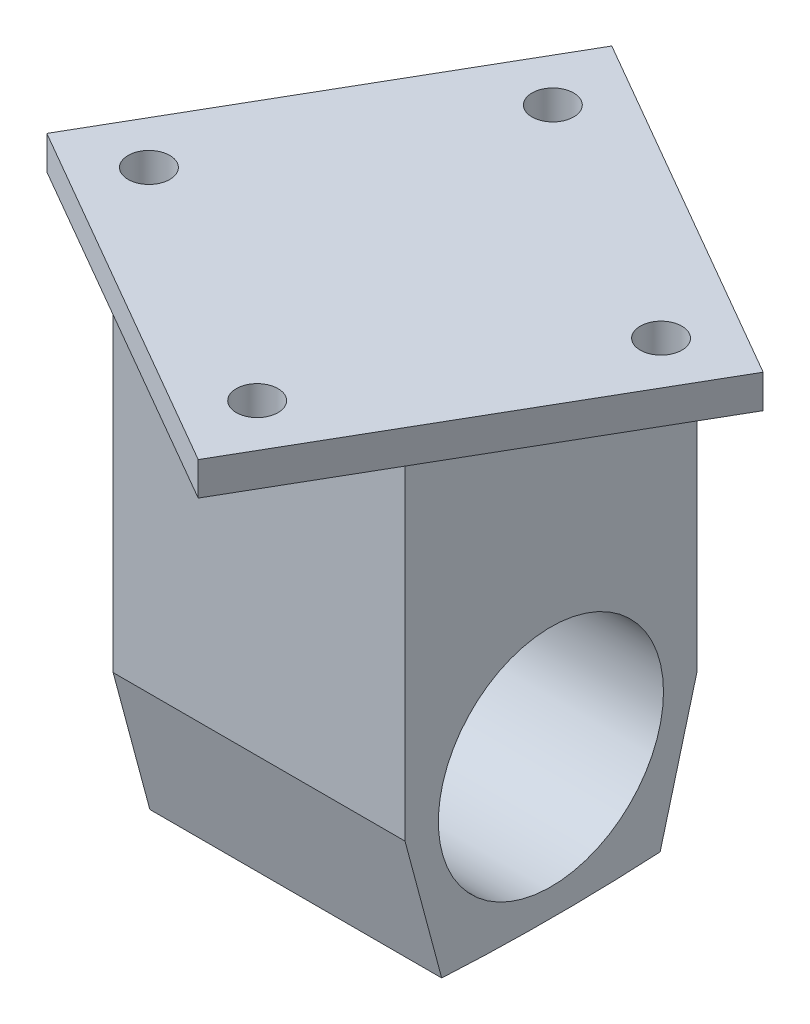
ISO-10303-21;
HEADER;
FILE_DESCRIPTION(('STEP AP214'),'2;1');
FILE_NAME('part.step','',(''),(''),'','','');
FILE_SCHEMA(('AUTOMOTIVE_DESIGN { 1 0 10303 214 1 1 1 1 }'));
ENDSEC;
DATA;
#1=APPLICATION_CONTEXT('core data for automotive mechanical design processes');
#2=APPLICATION_PROTOCOL_DEFINITION('international standard','automotive_design',2000,#1);
#3=PRODUCT_CONTEXT('',#1,'mechanical');
#4=PRODUCT('Part','Part','',(#3));
#5=PRODUCT_RELATED_PRODUCT_CATEGORY('part','',(#4));
#6=PRODUCT_DEFINITION_FORMATION('','',#4);
#7=PRODUCT_DEFINITION_CONTEXT('part definition',#1,'design');
#8=PRODUCT_DEFINITION('design','',#6,#7);
#9=PRODUCT_DEFINITION_SHAPE('','',#8);
#10=(LENGTH_UNIT() NAMED_UNIT(*) SI_UNIT(.MILLI.,.METRE.));
#11=(NAMED_UNIT(*) PLANE_ANGLE_UNIT() SI_UNIT($,.RADIAN.));
#12=(NAMED_UNIT(*) SI_UNIT($,.STERADIAN.) SOLID_ANGLE_UNIT());
#13=UNCERTAINTY_MEASURE_WITH_UNIT(LENGTH_MEASURE(1.E-05),#10,'distance_accuracy_value','');
#14=(GEOMETRIC_REPRESENTATION_CONTEXT(3) GLOBAL_UNCERTAINTY_ASSIGNED_CONTEXT((#13)) GLOBAL_UNIT_ASSIGNED_CONTEXT((#10,
#11,#12)) REPRESENTATION_CONTEXT('',''));
#15=CARTESIAN_POINT('',(0.,0.,0.));
#16=DIRECTION('',(0.,0.,1.));
#17=DIRECTION('',(1.,0.,0.));
#18=AXIS2_PLACEMENT_3D('',#15,#16,#17);
#19=CARTESIAN_POINT('',(22.225,50.292,22.225));
#20=DIRECTION('',(-1.,0.,0.));
#21=DIRECTION('',(0.,0.,1.));
#22=AXIS2_PLACEMENT_3D('',#19,#20,#21);
#23=PLANE('',#22);
#24=CARTESIAN_POINT('',(22.225,0.,0.));
#25=DIRECTION('',(1.,0.,0.));
#26=DIRECTION('',(0.,0.,-1.));
#27=AXIS2_PLACEMENT_3D('',#24,#25,#26);
#28=CIRCLE('',#27,17.145);
#29=CARTESIAN_POINT('',(22.225,0.,-17.145));
#30=VERTEX_POINT('',#29);
#31=EDGE_CURVE('E144',#30,#30,#28,.T.);
#32=ORIENTED_EDGE('',*,*,#31,.F.);
#33=EDGE_LOOP('',(#32));
#34=FACE_BOUND('',#33,.T.);
#35=DIRECTION('',(0.,-1.,0.));
#36=VECTOR('',#35,1.);
#37=CARTESIAN_POINT('',(22.225,50.292,22.225));
#38=LINE('',#37,#36);
#39=CARTESIAN_POINT('',(22.225,50.292,22.225));
#40=VERTEX_POINT('',#39);
#41=CARTESIAN_POINT('',(22.225,0.,22.225));
#42=VERTEX_POINT('',#41);
#43=EDGE_CURVE('E187',#40,#42,#38,.T.);
#44=ORIENTED_EDGE('',*,*,#43,.T.);
#45=DIRECTION('',(0.,-0.965925826289069,-0.258819045102518));
#46=VECTOR('',#45,1.);
#47=CARTESIAN_POINT('',(22.225,0.,22.225));
#48=LINE('',#47,#46);
#49=CARTESIAN_POINT('',(22.225,-20.854338589581,16.6370968162366));
#50=VERTEX_POINT('',#49);
#51=EDGE_CURVE('E156',#42,#50,#48,.T.);
#52=ORIENTED_EDGE('',*,*,#51,.T.);
#53=CARTESIAN_POINT('',(22.225,278.671939216944,4.82332470037233E-13));
#54=DIRECTION('',(-1.,0.,0.));
#55=DIRECTION('',(0.,0.,1.));
#56=AXIS2_PLACEMENT_3D('',#53,#54,#55);
#57=CIRCLE('',#56,299.987973237435);
#58=CARTESIAN_POINT('',(22.225,-20.854338589581,-16.6370968162366));
#59=VERTEX_POINT('',#58);
#60=EDGE_CURVE('E164',#59,#50,#57,.T.);
#61=ORIENTED_EDGE('',*,*,#60,.F.);
#62=DIRECTION('',(0.,-0.965925826289067,0.258819045102525));
#63=VECTOR('',#62,1.);
#64=CARTESIAN_POINT('',(22.225,0.,-22.225));
#65=LINE('',#64,#63);
#66=CARTESIAN_POINT('',(22.225,0.,-22.225));
#67=VERTEX_POINT('',#66);
#68=EDGE_CURVE('E162',#67,#59,#65,.T.);
#69=ORIENTED_EDGE('',*,*,#68,.F.);
#70=DIRECTION('',(0.,-1.,0.));
#71=VECTOR('',#70,1.);
#72=CARTESIAN_POINT('',(22.225,50.292,-22.225));
#73=LINE('',#72,#71);
#74=CARTESIAN_POINT('',(22.225,50.292,-22.225));
#75=VERTEX_POINT('',#74);
#76=EDGE_CURVE('E13',#75,#67,#73,.T.);
#77=ORIENTED_EDGE('',*,*,#76,.F.);
#78=DIRECTION('',(0.,0.,-1.));
#79=VECTOR('',#78,1.);
#80=CARTESIAN_POINT('',(22.225,50.292,22.225));
#81=LINE('',#80,#79);
#82=EDGE_CURVE('E174',#40,#75,#81,.T.);
#83=ORIENTED_EDGE('',*,*,#82,.F.);
#84=EDGE_LOOP('',(#44,#52,#61,#69,#77,#83));
#85=FACE_BOUND('',#84,.T.);
#86=ADVANCED_FACE('F44',(#34,#85),#23,.F.);
#87=CARTESIAN_POINT('',(-22.225,50.292,-22.225));
#88=DIRECTION('',(0.,0.,1.));
#89=DIRECTION('',(1.,0.,0.));
#90=AXIS2_PLACEMENT_3D('',#87,#88,#89);
#91=PLANE('',#90);
#92=DIRECTION('',(-1.,0.,0.));
#93=VECTOR('',#92,1.);
#94=CARTESIAN_POINT('',(-22.225,0.,-22.225));
#95=LINE('',#94,#93);
#96=CARTESIAN_POINT('',(-22.225,0.,-22.225));
#97=VERTEX_POINT('',#96);
#98=EDGE_CURVE('E173',#67,#97,#95,.T.);
#99=ORIENTED_EDGE('',*,*,#98,.T.);
#100=DIRECTION('',(0.,-1.,0.));
#101=VECTOR('',#100,1.);
#102=CARTESIAN_POINT('',(-22.225,50.292,-22.225));
#103=LINE('',#102,#101);
#104=CARTESIAN_POINT('',(-22.225,50.292,-22.225));
#105=VERTEX_POINT('',#104);
#106=EDGE_CURVE('E53',#105,#97,#103,.T.);
#107=ORIENTED_EDGE('',*,*,#106,.F.);
#108=DIRECTION('',(-1.,0.,0.));
#109=VECTOR('',#108,1.);
#110=CARTESIAN_POINT('',(-22.225,50.292,-22.225));
#111=LINE('',#110,#109);
#112=EDGE_CURVE('E177',#75,#105,#111,.T.);
#113=ORIENTED_EDGE('',*,*,#112,.F.);
#114=ORIENTED_EDGE('',*,*,#76,.T.);
#115=EDGE_LOOP('',(#99,#107,#113,#114));
#116=FACE_BOUND('',#115,.T.);
#117=ADVANCED_FACE('F271',(#116),#91,.F.);
#118=CARTESIAN_POINT('',(-22.225,50.292,22.225));
#119=DIRECTION('',(1.,0.,0.));
#120=DIRECTION('',(0.,0.,-1.));
#121=AXIS2_PLACEMENT_3D('',#118,#119,#120);
#122=PLANE('',#121);
#123=CARTESIAN_POINT('',(-22.225,0.,0.));
#124=DIRECTION('',(1.,0.,0.));
#125=DIRECTION('',(0.,0.,-1.));
#126=AXIS2_PLACEMENT_3D('',#123,#124,#125);
#127=CIRCLE('',#126,17.145);
#128=CARTESIAN_POINT('',(-22.225,0.,-17.145));
#129=VERTEX_POINT('',#128);
#130=EDGE_CURVE('E147',#129,#129,#127,.T.);
#131=ORIENTED_EDGE('',*,*,#130,.T.);
#132=EDGE_LOOP('',(#131));
#133=FACE_BOUND('',#132,.T.);
#134=ORIENTED_EDGE('',*,*,#106,.T.);
#135=DIRECTION('',(0.,-0.965925826289067,0.258819045102525));
#136=VECTOR('',#135,1.);
#137=CARTESIAN_POINT('',(-22.225,0.,-22.225));
#138=LINE('',#137,#136);
#139=CARTESIAN_POINT('',(-22.225,-20.854338589581,-16.6370968162366));
#140=VERTEX_POINT('',#139);
#141=EDGE_CURVE('E153',#97,#140,#138,.T.);
#142=ORIENTED_EDGE('',*,*,#141,.T.);
#143=CARTESIAN_POINT('',(-22.225,278.671939216944,4.82332470037233E-13));
#144=DIRECTION('',(-1.,0.,0.));
#145=DIRECTION('',(0.,0.,1.));
#146=AXIS2_PLACEMENT_3D('',#143,#144,#145);
#147=CIRCLE('',#146,299.987973237435);
#148=CARTESIAN_POINT('',(-22.225,-20.854338589581,16.6370968162366));
#149=VERTEX_POINT('',#148);
#150=EDGE_CURVE('E155',#140,#149,#147,.T.);
#151=ORIENTED_EDGE('',*,*,#150,.T.);
#152=DIRECTION('',(0.,-0.965925826289069,-0.258819045102518));
#153=VECTOR('',#152,1.);
#154=CARTESIAN_POINT('',(-22.225,0.,22.225));
#155=LINE('',#154,#153);
#156=CARTESIAN_POINT('',(-22.225,0.,22.225));
#157=VERTEX_POINT('',#156);
#158=EDGE_CURVE('E158',#157,#149,#155,.T.);
#159=ORIENTED_EDGE('',*,*,#158,.F.);
#160=DIRECTION('',(0.,-1.,0.));
#161=VECTOR('',#160,1.);
#162=CARTESIAN_POINT('',(-22.225,50.292,22.225));
#163=LINE('',#162,#161);
#164=CARTESIAN_POINT('',(-22.225,50.292,22.225));
#165=VERTEX_POINT('',#164);
#166=EDGE_CURVE('E61',#165,#157,#163,.T.);
#167=ORIENTED_EDGE('',*,*,#166,.F.);
#168=DIRECTION('',(0.,0.,1.));
#169=VECTOR('',#168,1.);
#170=CARTESIAN_POINT('',(-22.225,50.292,22.225));
#171=LINE('',#170,#169);
#172=EDGE_CURVE('E181',#105,#165,#171,.T.);
#173=ORIENTED_EDGE('',*,*,#172,.F.);
#174=EDGE_LOOP('',(#134,#142,#151,#159,#167,#173));
#175=FACE_BOUND('',#174,.T.);
#176=ADVANCED_FACE('F276',(#133,#175),#122,.F.);
#177=CARTESIAN_POINT('',(-22.225,50.292,22.225));
#178=DIRECTION('',(0.,0.,-1.));
#179=DIRECTION('',(-1.,0.,0.));
#180=AXIS2_PLACEMENT_3D('',#177,#178,#179);
#181=PLANE('',#180);
#182=DIRECTION('',(1.,0.,0.));
#183=VECTOR('',#182,1.);
#184=CARTESIAN_POINT('',(-22.225,0.,22.225));
#185=LINE('',#184,#183);
#186=EDGE_CURVE('E178',#157,#42,#185,.T.);
#187=ORIENTED_EDGE('',*,*,#186,.T.);
#188=ORIENTED_EDGE('',*,*,#43,.F.);
#189=DIRECTION('',(1.,0.,0.));
#190=VECTOR('',#189,1.);
#191=CARTESIAN_POINT('',(-22.225,50.292,22.225));
#192=LINE('',#191,#190);
#193=EDGE_CURVE('E184',#165,#40,#192,.T.);
#194=ORIENTED_EDGE('',*,*,#193,.F.);
#195=ORIENTED_EDGE('',*,*,#166,.T.);
#196=EDGE_LOOP('',(#187,#188,#194,#195));
#197=FACE_BOUND('',#196,.T.);
#198=ADVANCED_FACE('F284',(#197),#181,.F.);
#199=CARTESIAN_POINT('',(-22.225,0.,-22.225));
#200=DIRECTION('',(0.,0.258819045102525,0.965925826289067));
#201=DIRECTION('',(0.,-0.965925826289067,0.258819045102525));
#202=AXIS2_PLACEMENT_3D('',#199,#200,#201);
#203=PLANE('',#202);
#204=ORIENTED_EDGE('',*,*,#68,.T.);
#205=DIRECTION('',(1.,0.,0.));
#206=VECTOR('',#205,1.);
#207=CARTESIAN_POINT('',(-22.225,-20.854338589581,-16.6370968162366));
#208=LINE('',#207,#206);
#209=EDGE_CURVE('E170',#140,#59,#208,.T.);
#210=ORIENTED_EDGE('',*,*,#209,.F.);
#211=ORIENTED_EDGE('',*,*,#141,.F.);
#212=ORIENTED_EDGE('',*,*,#98,.F.);
#213=EDGE_LOOP('',(#204,#210,#211,#212));
#214=FACE_BOUND('',#213,.T.);
#215=ADVANCED_FACE('F290',(#214),#203,.F.);
#216=CARTESIAN_POINT('',(-22.225,278.671939216944,4.82332470037233E-13));
#217=DIRECTION('',(1.,0.,0.));
#218=DIRECTION('',(0.,0.,-1.));
#219=AXIS2_PLACEMENT_3D('',#216,#217,#218);
#220=CYLINDRICAL_SURFACE('',#219,299.987973237435);
#221=ORIENTED_EDGE('',*,*,#60,.T.);
#222=DIRECTION('',(1.,0.,0.));
#223=VECTOR('',#222,1.);
#224=CARTESIAN_POINT('',(-22.225,-20.854338589581,16.6370968162366));
#225=LINE('',#224,#223);
#226=EDGE_CURVE('E161',#149,#50,#225,.T.);
#227=ORIENTED_EDGE('',*,*,#226,.F.);
#228=ORIENTED_EDGE('',*,*,#150,.F.);
#229=ORIENTED_EDGE('',*,*,#209,.T.);
#230=EDGE_LOOP('',(#221,#227,#228,#229));
#231=FACE_BOUND('',#230,.T.);
#232=ADVANCED_FACE('F294',(#231),#220,.T.);
#233=CARTESIAN_POINT('',(-22.225,0.,22.225));
#234=DIRECTION('',(0.,-0.258819045102518,0.965925826289069));
#235=DIRECTION('',(0.,-0.965925826289069,-0.258819045102518));
#236=AXIS2_PLACEMENT_3D('',#233,#234,#235);
#237=PLANE('',#236);
#238=ORIENTED_EDGE('',*,*,#51,.F.);
#239=ORIENTED_EDGE('',*,*,#186,.F.);
#240=ORIENTED_EDGE('',*,*,#158,.T.);
#241=ORIENTED_EDGE('',*,*,#226,.T.);
#242=EDGE_LOOP('',(#238,#239,#240,#241));
#243=FACE_BOUND('',#242,.T.);
#244=ADVANCED_FACE('F296',(#243),#237,.T.);
#245=CARTESIAN_POINT('',(-104.775,0.,0.));
#246=DIRECTION('',(1.,0.,0.));
#247=DIRECTION('',(0.,0.,-1.));
#248=AXIS2_PLACEMENT_3D('',#245,#246,#247);
#249=CYLINDRICAL_SURFACE('',#248,17.145);
#250=ORIENTED_EDGE('',*,*,#31,.T.);
#251=EDGE_LOOP('',(#250));
#252=FACE_BOUND('',#251,.T.);
#253=ORIENTED_EDGE('',*,*,#130,.F.);
#254=EDGE_LOOP('',(#253));
#255=FACE_BOUND('',#254,.T.);
#256=ADVANCED_FACE('F298',(#252,#255),#249,.F.);
#257=CARTESIAN_POINT('',(-11.5283361175947,55.372,-43.0243361175947));
#258=DIRECTION('',(-0.499999999999999,0.,0.866025403784439));
#259=DIRECTION('',(0.866025403784439,0.,0.5));
#260=AXIS2_PLACEMENT_3D('',#257,#258,#259);
#261=PLANE('',#260);
#262=DIRECTION('',(-0.866025403784439,0.,-0.499999999999999));
#263=VECTOR('',#262,1.);
#264=CARTESIAN_POINT('',(-11.5283361175947,50.292,-43.0243361175947));
#265=LINE('',#264,#263);
#266=CARTESIAN_POINT('',(43.0243361175947,50.292,-11.5283361175947));
#267=VERTEX_POINT('',#266);
#268=CARTESIAN_POINT('',(-11.5283361175947,50.292,-43.0243361175947));
#269=VERTEX_POINT('',#268);
#270=EDGE_CURVE('E143',#267,#269,#265,.T.);
#271=ORIENTED_EDGE('',*,*,#270,.T.);
#272=DIRECTION('',(0.,-1.,0.));
#273=VECTOR('',#272,1.);
#274=CARTESIAN_POINT('',(-11.5283361175947,55.372,-43.0243361175947));
#275=LINE('',#274,#273);
#276=CARTESIAN_POINT('',(-11.5283361175947,55.372,-43.0243361175947));
#277=VERTEX_POINT('',#276);
#278=EDGE_CURVE('E123',#277,#269,#275,.T.);
#279=ORIENTED_EDGE('',*,*,#278,.F.);
#280=DIRECTION('',(-0.866025403784439,0.,-0.499999999999999));
#281=VECTOR('',#280,1.);
#282=CARTESIAN_POINT('',(-11.5283361175947,55.372,-43.0243361175947));
#283=LINE('',#282,#281);
#284=CARTESIAN_POINT('',(43.0243361175947,55.372,-11.5283361175947));
#285=VERTEX_POINT('',#284);
#286=EDGE_CURVE('E130',#285,#277,#283,.T.);
#287=ORIENTED_EDGE('',*,*,#286,.F.);
#288=DIRECTION('',(0.,-1.,0.));
#289=VECTOR('',#288,1.);
#290=CARTESIAN_POINT('',(43.0243361175947,55.372,-11.5283361175947));
#291=LINE('',#290,#289);
#292=EDGE_CURVE('E221',#285,#267,#291,.T.);
#293=ORIENTED_EDGE('',*,*,#292,.T.);
#294=EDGE_LOOP('',(#271,#279,#287,#293));
#295=FACE_BOUND('',#294,.T.);
#296=ADVANCED_FACE('F141',(#295),#261,.F.);
#297=CARTESIAN_POINT('',(-43.0243361175947,55.372,11.5283361175947));
#298=DIRECTION('',(0.866025403784439,0.,0.499999999999999));
#299=DIRECTION('',(0.499999999999999,0.,-0.866025403784439));
#300=AXIS2_PLACEMENT_3D('',#297,#298,#299);
#301=PLANE('',#300);
#302=DIRECTION('',(-0.499999999999999,0.,0.866025403784439));
#303=VECTOR('',#302,1.);
#304=CARTESIAN_POINT('',(-43.0243361175947,50.292,11.5283361175947));
#305=LINE('',#304,#303);
#306=CARTESIAN_POINT('',(-43.0243361175947,50.292,11.5283361175947));
#307=VERTEX_POINT('',#306);
#308=EDGE_CURVE('E212',#269,#307,#305,.T.);
#309=ORIENTED_EDGE('',*,*,#308,.T.);
#310=DIRECTION('',(0.,-1.,0.));
#311=VECTOR('',#310,1.);
#312=CARTESIAN_POINT('',(-43.0243361175947,55.372,11.5283361175947));
#313=LINE('',#312,#311);
#314=CARTESIAN_POINT('',(-43.0243361175947,55.372,11.5283361175947));
#315=VERTEX_POINT('',#314);
#316=EDGE_CURVE('E126',#315,#307,#313,.T.);
#317=ORIENTED_EDGE('',*,*,#316,.F.);
#318=DIRECTION('',(-0.499999999999999,0.,0.866025403784439));
#319=VECTOR('',#318,1.);
#320=CARTESIAN_POINT('',(-43.0243361175947,55.372,11.5283361175947));
#321=LINE('',#320,#319);
#322=EDGE_CURVE('E119',#277,#315,#321,.T.);
#323=ORIENTED_EDGE('',*,*,#322,.F.);
#324=ORIENTED_EDGE('',*,*,#278,.T.);
#325=EDGE_LOOP('',(#309,#317,#323,#324));
#326=FACE_BOUND('',#325,.T.);
#327=ADVANCED_FACE('F121',(#326),#301,.F.);
#328=CARTESIAN_POINT('',(11.5283361175947,55.372,43.0243361175947));
#329=DIRECTION('',(0.499999999999999,0.,-0.866025403784439));
#330=DIRECTION('',(-0.866025403784439,0.,-0.499999999999999));
#331=AXIS2_PLACEMENT_3D('',#328,#329,#330);
#332=PLANE('',#331);
#333=DIRECTION('',(0.866025403784439,0.,0.499999999999999));
#334=VECTOR('',#333,1.);
#335=CARTESIAN_POINT('',(11.5283361175947,50.292,43.0243361175947));
#336=LINE('',#335,#334);
#337=CARTESIAN_POINT('',(11.5283361175947,50.292,43.0243361175947));
#338=VERTEX_POINT('',#337);
#339=EDGE_CURVE('E214',#307,#338,#336,.T.);
#340=ORIENTED_EDGE('',*,*,#339,.T.);
#341=DIRECTION('',(0.,-1.,0.));
#342=VECTOR('',#341,1.);
#343=CARTESIAN_POINT('',(11.5283361175947,55.372,43.0243361175947));
#344=LINE('',#343,#342);
#345=CARTESIAN_POINT('',(11.5283361175947,55.372,43.0243361175947));
#346=VERTEX_POINT('',#345);
#347=EDGE_CURVE('E149',#346,#338,#344,.T.);
#348=ORIENTED_EDGE('',*,*,#347,.F.);
#349=DIRECTION('',(0.866025403784439,0.,0.499999999999999));
#350=VECTOR('',#349,1.);
#351=CARTESIAN_POINT('',(11.5283361175947,55.372,43.0243361175947));
#352=LINE('',#351,#350);
#353=EDGE_CURVE('E129',#315,#346,#352,.T.);
#354=ORIENTED_EDGE('',*,*,#353,.F.);
#355=ORIENTED_EDGE('',*,*,#316,.T.);
#356=EDGE_LOOP('',(#340,#348,#354,#355));
#357=FACE_BOUND('',#356,.T.);
#358=ADVANCED_FACE('F231',(#357),#332,.F.);
#359=CARTESIAN_POINT('',(43.0243361175947,55.372,-11.5283361175947));
#360=DIRECTION('',(-0.866025403784439,0.,-0.499999999999999));
#361=DIRECTION('',(-0.499999999999999,0.,0.866025403784439));
#362=AXIS2_PLACEMENT_3D('',#359,#360,#361);
#363=PLANE('',#362);
#364=DIRECTION('',(0.499999999999999,0.,-0.866025403784439));
#365=VECTOR('',#364,1.);
#366=CARTESIAN_POINT('',(43.0243361175947,50.292,-11.5283361175947));
#367=LINE('',#366,#365);
#368=EDGE_CURVE('E139',#338,#267,#367,.T.);
#369=ORIENTED_EDGE('',*,*,#368,.T.);
#370=ORIENTED_EDGE('',*,*,#292,.F.);
#371=DIRECTION('',(0.499999999999999,0.,-0.866025403784439));
#372=VECTOR('',#371,1.);
#373=CARTESIAN_POINT('',(43.0243361175947,55.372,-11.5283361175947));
#374=LINE('',#373,#372);
#375=EDGE_CURVE('E135',#346,#285,#374,.T.);
#376=ORIENTED_EDGE('',*,*,#375,.F.);
#377=ORIENTED_EDGE('',*,*,#347,.T.);
#378=EDGE_LOOP('',(#369,#370,#376,#377));
#379=FACE_BOUND('',#378,.T.);
#380=ADVANCED_FACE('F226',(#379),#363,.F.);
#381=CARTESIAN_POINT('',(0.,55.372,0.));
#382=DIRECTION('',(0.,-1.,0.));
#383=DIRECTION('',(0.,0.,-1.));
#384=AXIS2_PLACEMENT_3D('',#381,#382,#383);
#385=PLANE('',#384);
#386=CARTESIAN_POINT('',(30.7570781237235,55.372,-8.24133424479279));
#387=DIRECTION('',(0.,1.,0.));
#388=DIRECTION('',(0.,0.,1.));
#389=AXIS2_PLACEMENT_3D('',#386,#387,#388);
#390=CIRCLE('',#389,3.17500000000001);
#391=CARTESIAN_POINT('',(30.7570781237235,55.372,-5.06633424479278));
#392=VERTEX_POINT('',#391);
#393=EDGE_CURVE('E203',#392,#392,#390,.T.);
#394=ORIENTED_EDGE('',*,*,#393,.F.);
#395=EDGE_LOOP('',(#394));
#396=FACE_BOUND('',#395,.T.);
#397=CARTESIAN_POINT('',(8.24133424479273,55.372,30.7570781237235));
#398=DIRECTION('',(0.,1.,0.));
#399=DIRECTION('',(0.,0.,1.));
#400=AXIS2_PLACEMENT_3D('',#397,#398,#399);
#401=CIRCLE('',#400,3.175);
#402=CARTESIAN_POINT('',(8.24133424479273,55.372,33.9320781237235));
#403=VERTEX_POINT('',#402);
#404=EDGE_CURVE('E239',#403,#403,#401,.T.);
#405=ORIENTED_EDGE('',*,*,#404,.F.);
#406=EDGE_LOOP('',(#405));
#407=FACE_BOUND('',#406,.T.);
#408=CARTESIAN_POINT('',(-8.24133424479278,55.372,-30.7570781237235));
#409=DIRECTION('',(0.,1.,0.));
#410=DIRECTION('',(0.,0.,-1.));
#411=AXIS2_PLACEMENT_3D('',#408,#409,#410);
#412=CIRCLE('',#411,3.175);
#413=CARTESIAN_POINT('',(-8.24133424479278,55.372,-33.9320781237235));
#414=VERTEX_POINT('',#413);
#415=EDGE_CURVE('E236',#414,#414,#412,.T.);
#416=ORIENTED_EDGE('',*,*,#415,.F.);
#417=EDGE_LOOP('',(#416));
#418=FACE_BOUND('',#417,.T.);
#419=CARTESIAN_POINT('',(-30.7570781237235,55.372,8.24133424479271));
#420=DIRECTION('',(0.,1.,0.));
#421=DIRECTION('',(0.,0.,-1.));
#422=AXIS2_PLACEMENT_3D('',#419,#420,#421);
#423=CIRCLE('',#422,3.175);
#424=CARTESIAN_POINT('',(-30.7570781237235,55.372,5.06633424479272));
#425=VERTEX_POINT('',#424);
#426=EDGE_CURVE('E233',#425,#425,#423,.T.);
#427=ORIENTED_EDGE('',*,*,#426,.F.);
#428=EDGE_LOOP('',(#427));
#429=FACE_BOUND('',#428,.T.);
#430=ORIENTED_EDGE('',*,*,#286,.T.);
#431=ORIENTED_EDGE('',*,*,#322,.T.);
#432=ORIENTED_EDGE('',*,*,#353,.T.);
#433=ORIENTED_EDGE('',*,*,#375,.T.);
#434=EDGE_LOOP('',(#430,#431,#432,#433));
#435=FACE_BOUND('',#434,.T.);
#436=ADVANCED_FACE('F133',(#396,#407,#418,#429,#435),#385,.F.);
#437=CARTESIAN_POINT('',(0.,50.292,0.));
#438=DIRECTION('',(0.,-1.,0.));
#439=DIRECTION('',(0.,0.,-1.));
#440=AXIS2_PLACEMENT_3D('',#437,#438,#439);
#441=PLANE('',#440);
#442=CARTESIAN_POINT('',(30.7570781237235,50.292,-8.24133424479279));
#443=DIRECTION('',(0.,-1.,0.));
#444=DIRECTION('',(0.,0.,-1.));
#445=AXIS2_PLACEMENT_3D('',#442,#443,#444);
#446=CIRCLE('',#445,3.17500000000001);
#447=CARTESIAN_POINT('',(30.7570781237235,50.292,-11.4163342447928));
#448=VERTEX_POINT('',#447);
#449=EDGE_CURVE('E47',#448,#448,#446,.T.);
#450=ORIENTED_EDGE('',*,*,#449,.F.);
#451=EDGE_LOOP('',(#450));
#452=FACE_BOUND('',#451,.T.);
#453=CARTESIAN_POINT('',(8.24133424479273,50.292,30.7570781237235));
#454=DIRECTION('',(0.,-1.,0.));
#455=DIRECTION('',(0.,0.,-1.));
#456=AXIS2_PLACEMENT_3D('',#453,#454,#455);
#457=CIRCLE('',#456,3.175);
#458=CARTESIAN_POINT('',(8.24133424479273,50.292,27.5820781237235));
#459=VERTEX_POINT('',#458);
#460=EDGE_CURVE('E205',#459,#459,#457,.T.);
#461=ORIENTED_EDGE('',*,*,#460,.F.);
#462=EDGE_LOOP('',(#461));
#463=FACE_BOUND('',#462,.T.);
#464=CARTESIAN_POINT('',(-8.24133424479278,50.292,-30.7570781237235));
#465=DIRECTION('',(0.,-1.,0.));
#466=DIRECTION('',(0.,0.,-1.));
#467=AXIS2_PLACEMENT_3D('',#464,#465,#466);
#468=CIRCLE('',#467,3.175);
#469=CARTESIAN_POINT('',(-8.24133424479278,50.292,-33.9320781237235));
#470=VERTEX_POINT('',#469);
#471=EDGE_CURVE('E202',#470,#470,#468,.T.);
#472=ORIENTED_EDGE('',*,*,#471,.F.);
#473=EDGE_LOOP('',(#472));
#474=FACE_BOUND('',#473,.T.);
#475=CARTESIAN_POINT('',(-30.7570781237235,50.292,8.24133424479271));
#476=DIRECTION('',(0.,-1.,0.));
#477=DIRECTION('',(0.,0.,-1.));
#478=AXIS2_PLACEMENT_3D('',#475,#476,#477);
#479=CIRCLE('',#478,3.175);
#480=CARTESIAN_POINT('',(-30.7570781237235,50.292,5.06633424479272));
#481=VERTEX_POINT('',#480);
#482=EDGE_CURVE('E199',#481,#481,#479,.T.);
#483=ORIENTED_EDGE('',*,*,#482,.F.);
#484=EDGE_LOOP('',(#483));
#485=FACE_BOUND('',#484,.T.);
#486=ORIENTED_EDGE('',*,*,#193,.T.);
#487=ORIENTED_EDGE('',*,*,#82,.T.);
#488=ORIENTED_EDGE('',*,*,#112,.T.);
#489=ORIENTED_EDGE('',*,*,#172,.T.);
#490=EDGE_LOOP('',(#486,#487,#488,#489));
#491=FACE_BOUND('',#490,.T.);
#492=ORIENTED_EDGE('',*,*,#270,.F.);
#493=ORIENTED_EDGE('',*,*,#368,.F.);
#494=ORIENTED_EDGE('',*,*,#339,.F.);
#495=ORIENTED_EDGE('',*,*,#308,.F.);
#496=EDGE_LOOP('',(#492,#493,#494,#495));
#497=FACE_BOUND('',#496,.T.);
#498=ADVANCED_FACE('F230',(#452,#463,#474,#485,#491,#497),#441,.T.);
#499=CARTESIAN_POINT('',(-30.7570781237235,-21.3160340204917,8.24133424479271));
#500=DIRECTION('',(0.,1.,0.));
#501=DIRECTION('',(0.,0.,1.));
#502=AXIS2_PLACEMENT_3D('',#499,#500,#501);
#503=CYLINDRICAL_SURFACE('',#502,3.175);
#504=ORIENTED_EDGE('',*,*,#482,.T.);
#505=EDGE_LOOP('',(#504));
#506=FACE_BOUND('',#505,.T.);
#507=ORIENTED_EDGE('',*,*,#426,.T.);
#508=EDGE_LOOP('',(#507));
#509=FACE_BOUND('',#508,.T.);
#510=ADVANCED_FACE('F256',(#506,#509),#503,.F.);
#511=CARTESIAN_POINT('',(-8.24133424479278,-21.3160340204917,-30.7570781237235));
#512=DIRECTION('',(0.,1.,0.));
#513=DIRECTION('',(0.,0.,1.));
#514=AXIS2_PLACEMENT_3D('',#511,#512,#513);
#515=CYLINDRICAL_SURFACE('',#514,3.175);
#516=ORIENTED_EDGE('',*,*,#471,.T.);
#517=EDGE_LOOP('',(#516));
#518=FACE_BOUND('',#517,.T.);
#519=ORIENTED_EDGE('',*,*,#415,.T.);
#520=EDGE_LOOP('',(#519));
#521=FACE_BOUND('',#520,.T.);
#522=ADVANCED_FACE('F258',(#518,#521),#515,.F.);
#523=CARTESIAN_POINT('',(8.24133424479273,-21.3160340204917,30.7570781237235));
#524=DIRECTION('',(0.,1.,0.));
#525=DIRECTION('',(0.,0.,1.));
#526=AXIS2_PLACEMENT_3D('',#523,#524,#525);
#527=CYLINDRICAL_SURFACE('',#526,3.175);
#528=ORIENTED_EDGE('',*,*,#460,.T.);
#529=EDGE_LOOP('',(#528));
#530=FACE_BOUND('',#529,.T.);
#531=ORIENTED_EDGE('',*,*,#404,.T.);
#532=EDGE_LOOP('',(#531));
#533=FACE_BOUND('',#532,.T.);
#534=ADVANCED_FACE('F265',(#530,#533),#527,.F.);
#535=CARTESIAN_POINT('',(30.7570781237235,-21.3160340204917,-8.24133424479279));
#536=DIRECTION('',(0.,1.,0.));
#537=DIRECTION('',(0.,0.,1.));
#538=AXIS2_PLACEMENT_3D('',#535,#536,#537);
#539=CYLINDRICAL_SURFACE('',#538,3.17500000000001);
#540=ORIENTED_EDGE('',*,*,#449,.T.);
#541=EDGE_LOOP('',(#540));
#542=FACE_BOUND('',#541,.T.);
#543=ORIENTED_EDGE('',*,*,#393,.T.);
#544=EDGE_LOOP('',(#543));
#545=FACE_BOUND('',#544,.T.);
#546=ADVANCED_FACE('F245',(#542,#545),#539,.F.);
#547=CLOSED_SHELL('',(#86,#117,#176,#198,#215,#232,#244,#256,#296,#327,#358,#380,#436,#498,#510,
#522,#534,#546));
#548=MANIFOLD_SOLID_BREP('B2',#547);
#549=ADVANCED_BREP_SHAPE_REPRESENTATION('',(#18,#548),#14);
#550=SHAPE_DEFINITION_REPRESENTATION(#9,#549);
ENDSEC;
END-ISO-10303-21;
